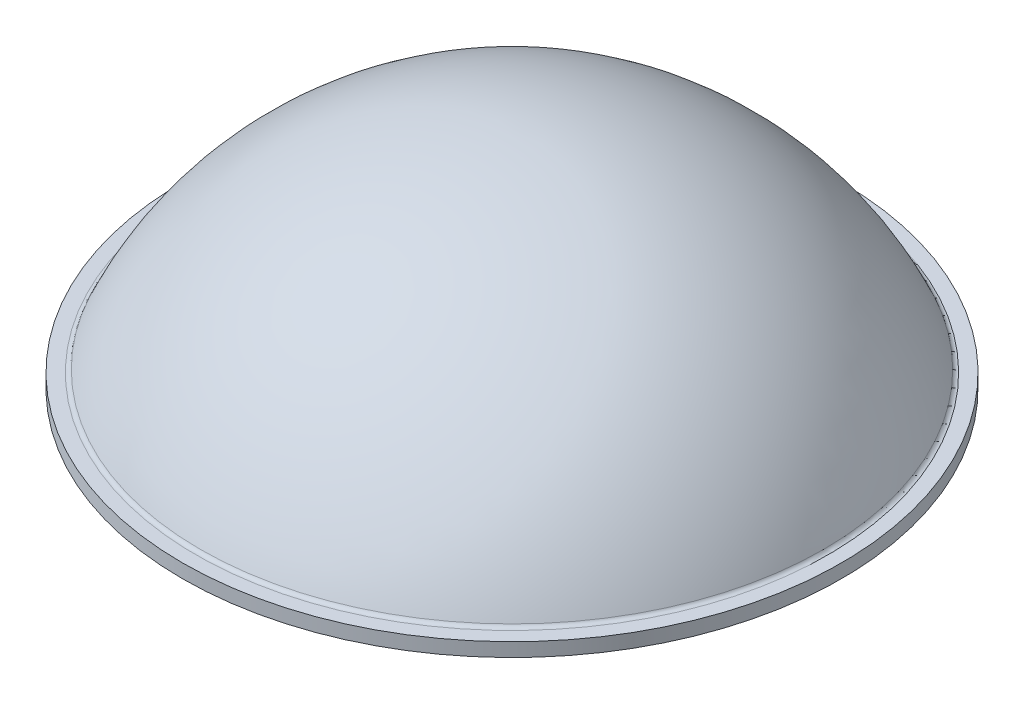
ISO-10303-21;
HEADER;
FILE_DESCRIPTION(('STEP AP214'),'2;1');
FILE_NAME('part.step','',(''),(''),'','','');
FILE_SCHEMA(('AUTOMOTIVE_DESIGN { 1 0 10303 214 1 1 1 1 }'));
ENDSEC;
DATA;
#1=APPLICATION_CONTEXT('core data for automotive mechanical design processes');
#2=APPLICATION_PROTOCOL_DEFINITION('international standard','automotive_design',2000,#1);
#3=PRODUCT_CONTEXT('',#1,'mechanical');
#4=PRODUCT('Part','Part','',(#3));
#5=PRODUCT_RELATED_PRODUCT_CATEGORY('part','',(#4));
#6=PRODUCT_DEFINITION_FORMATION('','',#4);
#7=PRODUCT_DEFINITION_CONTEXT('part definition',#1,'design');
#8=PRODUCT_DEFINITION('design','',#6,#7);
#9=PRODUCT_DEFINITION_SHAPE('','',#8);
#10=(LENGTH_UNIT() NAMED_UNIT(*) SI_UNIT(.MILLI.,.METRE.));
#11=(NAMED_UNIT(*) PLANE_ANGLE_UNIT() SI_UNIT($,.RADIAN.));
#12=(NAMED_UNIT(*) SI_UNIT($,.STERADIAN.) SOLID_ANGLE_UNIT());
#13=UNCERTAINTY_MEASURE_WITH_UNIT(LENGTH_MEASURE(1.E-05),#10,'distance_accuracy_value','');
#14=(GEOMETRIC_REPRESENTATION_CONTEXT(3) GLOBAL_UNCERTAINTY_ASSIGNED_CONTEXT((#13)) GLOBAL_UNIT_ASSIGNED_CONTEXT((#10,
#11,#12)) REPRESENTATION_CONTEXT('',''));
#15=CARTESIAN_POINT('',(0.,0.,0.));
#16=DIRECTION('',(0.,0.,1.));
#17=DIRECTION('',(1.,0.,0.));
#18=AXIS2_PLACEMENT_3D('',#15,#16,#17);
#19=CARTESIAN_POINT('',(0.,0.,0.));
#20=DIRECTION('',(0.,1.,0.));
#21=DIRECTION('',(0.,0.,1.));
#22=AXIS2_PLACEMENT_3D('',#19,#20,#21);
#23=PLANE('',#22);
#24=CARTESIAN_POINT('',(0.,0.,0.));
#25=DIRECTION('',(0.,-1.,0.));
#26=DIRECTION('',(0.,0.,-1.));
#27=AXIS2_PLACEMENT_3D('',#24,#25,#26);
#28=CIRCLE('',#27,4.7625);
#29=CARTESIAN_POINT('',(0.,0.,-4.7625));
#30=VERTEX_POINT('',#29);
#31=EDGE_CURVE('E10',#30,#30,#28,.T.);
#32=ORIENTED_EDGE('',*,*,#31,.T.);
#33=EDGE_LOOP('',(#32));
#34=FACE_BOUND('',#33,.T.);
#35=ADVANCED_FACE('F30',(#34),#23,.F.);
#36=CARTESIAN_POINT('',(0.,0.,0.));
#37=DIRECTION('',(0.,-1.,0.));
#38=DIRECTION('',(0.,0.,-1.));
#39=AXIS2_PLACEMENT_3D('',#36,#37,#38);
#40=CYLINDRICAL_SURFACE('',#39,4.7625);
#41=ORIENTED_EDGE('',*,*,#31,.F.);
#42=EDGE_LOOP('',(#41));
#43=FACE_BOUND('',#42,.T.);
#44=CARTESIAN_POINT('',(0.,0.1984375,0.));
#45=DIRECTION('',(0.,-1.,0.));
#46=DIRECTION('',(0.,0.,-1.));
#47=AXIS2_PLACEMENT_3D('',#44,#45,#46);
#48=CIRCLE('',#47,4.7625);
#49=CARTESIAN_POINT('',(0.,0.1984375,-4.7625));
#50=VERTEX_POINT('',#49);
#51=EDGE_CURVE('E36',#50,#50,#48,.T.);
#52=ORIENTED_EDGE('',*,*,#51,.T.);
#53=EDGE_LOOP('',(#52));
#54=FACE_BOUND('',#53,.T.);
#55=ADVANCED_FACE('F62',(#43,#54),#40,.T.);
#56=CARTESIAN_POINT('',(0.,0.1984375,4.7625));
#57=DIRECTION('',(0.,-1.,0.));
#58=DIRECTION('',(0.,0.,-1.));
#59=AXIS2_PLACEMENT_3D('',#56,#57,#58);
#60=PLANE('',#59);
#61=ORIENTED_EDGE('',*,*,#51,.F.);
#62=EDGE_LOOP('',(#61));
#63=FACE_BOUND('',#62,.T.);
#64=CARTESIAN_POINT('',(0.,0.1984375,0.));
#65=DIRECTION('',(0.,-1.,0.));
#66=DIRECTION('',(0.,0.,-1.));
#67=AXIS2_PLACEMENT_3D('',#64,#65,#66);
#68=CIRCLE('',#67,4.5640625);
#69=CARTESIAN_POINT('',(0.,0.1984375,-4.5640625));
#70=VERTEX_POINT('',#69);
#71=EDGE_CURVE('E40',#70,#70,#68,.T.);
#72=ORIENTED_EDGE('',*,*,#71,.T.);
#73=EDGE_LOOP('',(#72));
#74=FACE_BOUND('',#73,.T.);
#75=ADVANCED_FACE('F58',(#63,#74),#60,.F.);
#76=CARTESIAN_POINT('',(0.,0.264583333333333,0.));
#77=DIRECTION('',(0.,-1.,0.));
#78=DIRECTION('',(0.,0.,-1.));
#79=AXIS2_PLACEMENT_3D('',#76,#77,#78);
#80=TOROIDAL_SURFACE('',#79,4.5640625,0.0661458333333333);
#81=ORIENTED_EDGE('',*,*,#71,.F.);
#82=EDGE_LOOP('',(#81));
#83=FACE_BOUND('',#82,.T.);
#84=CARTESIAN_POINT('',(0.,0.237914456233422,0.));
#85=DIRECTION('',(0.,-1.,0.));
#86=DIRECTION('',(0.,0.,-1.));
#87=AXIS2_PLACEMENT_3D('',#84,#85,#86);
#88=CIRCLE('',#87,4.50353116710875);
#89=CARTESIAN_POINT('',(0.,0.237914456233422,-4.50353116710875));
#90=VERTEX_POINT('',#89);
#91=EDGE_CURVE('E44',#90,#90,#88,.T.);
#92=ORIENTED_EDGE('',*,*,#91,.T.);
#93=EDGE_LOOP('',(#92));
#94=FACE_BOUND('',#93,.T.);
#95=ADVANCED_FACE('F50',(#83,#94),#80,.F.);
#96=CARTESIAN_POINT('',(0.,-1.74625,0.));
#97=DIRECTION('',(0.,-1.,0.));
#98=DIRECTION('',(0.,0.,1.));
#99=AXIS2_PLACEMENT_3D('',#96,#97,#98);
#100=SPHERICAL_SURFACE('',#99,4.92125);
#101=ORIENTED_EDGE('',*,*,#91,.F.);
#102=EDGE_LOOP('',(#101));
#103=FACE_BOUND('',#102,.T.);
#104=ADVANCED_FACE('F52',(#103),#100,.T.);
#105=CLOSED_SHELL('',(#35,#55,#75,#95,#104));
#106=MANIFOLD_SOLID_BREP('B2',#105);
#107=ADVANCED_BREP_SHAPE_REPRESENTATION('',(#18,#106),#14);
#108=SHAPE_DEFINITION_REPRESENTATION(#9,#107);
ENDSEC;
END-ISO-10303-21;
